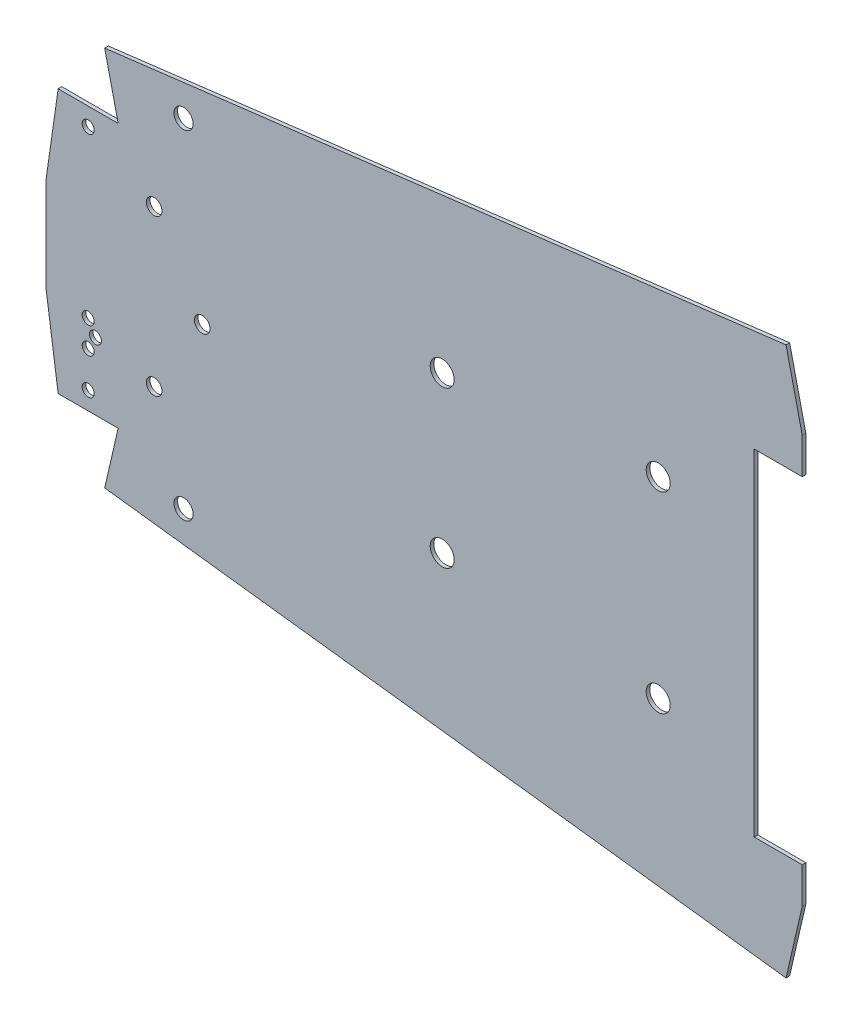
ISO-10303-21;
HEADER;
FILE_DESCRIPTION(('STEP AP214'),'2;1');
FILE_NAME('part.step','',(''),(''),'','','');
FILE_SCHEMA(('AUTOMOTIVE_DESIGN { 1 0 10303 214 1 1 1 1 }'));
ENDSEC;
DATA;
#1=APPLICATION_CONTEXT('core data for automotive mechanical design processes');
#2=APPLICATION_PROTOCOL_DEFINITION('international standard','automotive_design',2000,#1);
#3=PRODUCT_CONTEXT('',#1,'mechanical');
#4=PRODUCT('Part','Part','',(#3));
#5=PRODUCT_RELATED_PRODUCT_CATEGORY('part','',(#4));
#6=PRODUCT_DEFINITION_FORMATION('','',#4);
#7=PRODUCT_DEFINITION_CONTEXT('part definition',#1,'design');
#8=PRODUCT_DEFINITION('design','',#6,#7);
#9=PRODUCT_DEFINITION_SHAPE('','',#8);
#10=(LENGTH_UNIT() NAMED_UNIT(*) SI_UNIT(.MILLI.,.METRE.));
#11=(NAMED_UNIT(*) PLANE_ANGLE_UNIT() SI_UNIT($,.RADIAN.));
#12=(NAMED_UNIT(*) SI_UNIT($,.STERADIAN.) SOLID_ANGLE_UNIT());
#13=UNCERTAINTY_MEASURE_WITH_UNIT(LENGTH_MEASURE(1.E-05),#10,'distance_accuracy_value','');
#14=(GEOMETRIC_REPRESENTATION_CONTEXT(3) GLOBAL_UNCERTAINTY_ASSIGNED_CONTEXT((#13)) GLOBAL_UNIT_ASSIGNED_CONTEXT((#10,
#11,#12)) REPRESENTATION_CONTEXT('',''));
#15=CARTESIAN_POINT('',(0.,0.,0.));
#16=DIRECTION('',(0.,0.,1.));
#17=DIRECTION('',(1.,0.,0.));
#18=AXIS2_PLACEMENT_3D('',#15,#16,#17);
#19=CARTESIAN_POINT('',(-12.8984468051729,105.000156556674,-0.0001));
#20=DIRECTION('',(0.121925670687679,-0.992539233898267,0.));
#21=DIRECTION('',(0.992539233898268,0.121925670687679,0.));
#22=AXIS2_PLACEMENT_3D('',#19,#20,#21);
#23=PLANE('',#22);
#24=DIRECTION('',(0.,0.,1.));
#25=VECTOR('',#24,1.);
#26=CARTESIAN_POINT('',(-221.628929886641,79.3592516196309,-0.0001));
#27=LINE('',#26,#25);
#28=CARTESIAN_POINT('',(-221.628929886641,79.3592516196309,-0.0001));
#29=VERTEX_POINT('',#28);
#30=CARTESIAN_POINT('',(-221.628929886641,79.3592516196309,1.5));
#31=VERTEX_POINT('',#30);
#32=EDGE_CURVE('E43',#29,#31,#27,.T.);
#33=ORIENTED_EDGE('',*,*,#32,.T.);
#34=DIRECTION('',(0.992539233898268,0.121925670687679,0.));
#35=VECTOR('',#34,1.);
#36=CARTESIAN_POINT('',(-12.8984468051729,105.000156556674,1.5));
#37=LINE('',#36,#35);
#38=CARTESIAN_POINT('',(62.2463148416396,114.231101943557,1.5));
#39=VERTEX_POINT('',#38);
#40=EDGE_CURVE('E155',#31,#39,#37,.T.);
#41=ORIENTED_EDGE('',*,*,#40,.T.);
#42=DIRECTION('',(0.,0.,1.));
#43=VECTOR('',#42,1.);
#44=CARTESIAN_POINT('',(62.2463148416396,114.231101943557,-0.0001));
#45=LINE('',#44,#43);
#46=CARTESIAN_POINT('',(62.2463148416396,114.231101943557,-0.0001));
#47=VERTEX_POINT('',#46);
#48=EDGE_CURVE('E11',#47,#39,#45,.T.);
#49=ORIENTED_EDGE('',*,*,#48,.F.);
#50=DIRECTION('',(0.992539233898268,0.121925670687679,0.));
#51=VECTOR('',#50,1.);
#52=CARTESIAN_POINT('',(-12.8984468051729,105.000156556674,-0.0001));
#53=LINE('',#52,#51);
#54=EDGE_CURVE('E56',#29,#47,#53,.T.);
#55=ORIENTED_EDGE('',*,*,#54,.F.);
#56=EDGE_LOOP('',(#33,#41,#49,#55));
#57=FACE_BOUND('',#56,.T.);
#58=ADVANCED_FACE('F39',(#57),#23,.F.);
#59=CARTESIAN_POINT('',(84.1342755916733,19.4239280175096,-0.0001));
#60=DIRECTION('',(0.974370064785234,0.224951054343869,0.));
#61=DIRECTION('',(-0.224951054343869,0.974370064785234,0.));
#62=AXIS2_PLACEMENT_3D('',#59,#60,#61);
#63=PLANE('',#62);
#64=ORIENTED_EDGE('',*,*,#48,.T.);
#65=DIRECTION('',(-0.224951054343869,0.974370064785234,0.));
#66=VECTOR('',#65,1.);
#67=CARTESIAN_POINT('',(84.1342755916733,19.4239280175096,1.5));
#68=LINE('',#67,#66);
#69=CARTESIAN_POINT('',(68.9948464719557,85.,1.5));
#70=VERTEX_POINT('',#69);
#71=EDGE_CURVE('E169',#70,#39,#68,.T.);
#72=ORIENTED_EDGE('',*,*,#71,.F.);
#73=DIRECTION('',(0.,0.,1.));
#74=VECTOR('',#73,1.);
#75=CARTESIAN_POINT('',(68.9948464719557,85.,-0.0001));
#76=LINE('',#75,#74);
#77=CARTESIAN_POINT('',(68.9948464719557,85.,-0.0001));
#78=VERTEX_POINT('',#77);
#79=EDGE_CURVE('E48',#78,#70,#76,.T.);
#80=ORIENTED_EDGE('',*,*,#79,.F.);
#81=DIRECTION('',(-0.224951054343869,0.974370064785234,0.));
#82=VECTOR('',#81,1.);
#83=CARTESIAN_POINT('',(84.1342755916733,19.4239280175096,-0.0001));
#84=LINE('',#83,#82);
#85=EDGE_CURVE('E290',#78,#47,#84,.T.);
#86=ORIENTED_EDGE('',*,*,#85,.T.);
#87=EDGE_LOOP('',(#64,#72,#80,#86));
#88=FACE_BOUND('',#87,.T.);
#89=ADVANCED_FACE('F409',(#88),#63,.T.);
#90=CARTESIAN_POINT('',(68.9948464719557,0.,-0.0001));
#91=DIRECTION('',(1.,0.,0.));
#92=DIRECTION('',(0.,0.,-1.));
#93=AXIS2_PLACEMENT_3D('',#90,#91,#92);
#94=PLANE('',#93);
#95=ORIENTED_EDGE('',*,*,#79,.T.);
#96=DIRECTION('',(0.,1.,0.));
#97=VECTOR('',#96,1.);
#98=CARTESIAN_POINT('',(68.9948464719557,0.,1.5));
#99=LINE('',#98,#97);
#100=CARTESIAN_POINT('',(68.9948464719557,70.,1.5));
#101=VERTEX_POINT('',#100);
#102=EDGE_CURVE('E212',#101,#70,#99,.T.);
#103=ORIENTED_EDGE('',*,*,#102,.F.);
#104=DIRECTION('',(0.,0.,1.));
#105=VECTOR('',#104,1.);
#106=CARTESIAN_POINT('',(68.9948464719557,70.,-0.0001));
#107=LINE('',#106,#105);
#108=CARTESIAN_POINT('',(68.9948464719557,70.,-0.0001));
#109=VERTEX_POINT('',#108);
#110=EDGE_CURVE('E328',#109,#101,#107,.T.);
#111=ORIENTED_EDGE('',*,*,#110,.F.);
#112=DIRECTION('',(0.,1.,0.));
#113=VECTOR('',#112,1.);
#114=CARTESIAN_POINT('',(68.9948464719557,0.,-0.0001));
#115=LINE('',#114,#113);
#116=EDGE_CURVE('E288',#109,#78,#115,.T.);
#117=ORIENTED_EDGE('',*,*,#116,.T.);
#118=EDGE_LOOP('',(#95,#103,#111,#117));
#119=FACE_BOUND('',#118,.T.);
#120=ADVANCED_FACE('F407',(#119),#94,.T.);
#121=CARTESIAN_POINT('',(0.,70.,-0.0001));
#122=DIRECTION('',(0.,-1.,0.));
#123=DIRECTION('',(0.,0.,-1.));
#124=AXIS2_PLACEMENT_3D('',#121,#122,#123);
#125=PLANE('',#124);
#126=ORIENTED_EDGE('',*,*,#110,.T.);
#127=DIRECTION('',(1.,0.,0.));
#128=VECTOR('',#127,1.);
#129=CARTESIAN_POINT('',(0.,70.,1.5));
#130=LINE('',#129,#128);
#131=CARTESIAN_POINT('',(48.9948464719557,70.,1.5));
#132=VERTEX_POINT('',#131);
#133=EDGE_CURVE('E209',#132,#101,#130,.T.);
#134=ORIENTED_EDGE('',*,*,#133,.F.);
#135=DIRECTION('',(0.,0.,1.));
#136=VECTOR('',#135,1.);
#137=CARTESIAN_POINT('',(48.9948464719557,70.,-0.0001));
#138=LINE('',#137,#136);
#139=CARTESIAN_POINT('',(48.9948464719557,70.,-0.0001));
#140=VERTEX_POINT('',#139);
#141=EDGE_CURVE('E330',#140,#132,#138,.T.);
#142=ORIENTED_EDGE('',*,*,#141,.F.);
#143=DIRECTION('',(1.,0.,0.));
#144=VECTOR('',#143,1.);
#145=CARTESIAN_POINT('',(0.,70.,-0.0001));
#146=LINE('',#145,#144);
#147=EDGE_CURVE('E285',#140,#109,#146,.T.);
#148=ORIENTED_EDGE('',*,*,#147,.T.);
#149=EDGE_LOOP('',(#126,#134,#142,#148));
#150=FACE_BOUND('',#149,.T.);
#151=ADVANCED_FACE('F404',(#150),#125,.T.);
#152=CARTESIAN_POINT('',(48.9948464719557,0.,-0.0001));
#153=DIRECTION('',(-1.,0.,0.));
#154=DIRECTION('',(0.,0.,1.));
#155=AXIS2_PLACEMENT_3D('',#152,#153,#154);
#156=PLANE('',#155);
#157=ORIENTED_EDGE('',*,*,#141,.T.);
#158=DIRECTION('',(0.,-1.,0.));
#159=VECTOR('',#158,1.);
#160=CARTESIAN_POINT('',(48.9948464719557,0.,1.5));
#161=LINE('',#160,#159);
#162=CARTESIAN_POINT('',(48.9948464719557,-70.,1.5));
#163=VERTEX_POINT('',#162);
#164=EDGE_CURVE('E206',#132,#163,#161,.T.);
#165=ORIENTED_EDGE('',*,*,#164,.T.);
#166=DIRECTION('',(0.,0.,1.));
#167=VECTOR('',#166,1.);
#168=CARTESIAN_POINT('',(48.9948464719557,-70.,-0.0001));
#169=LINE('',#168,#167);
#170=CARTESIAN_POINT('',(48.9948464719557,-70.,-0.0001));
#171=VERTEX_POINT('',#170);
#172=EDGE_CURVE('E332',#171,#163,#169,.T.);
#173=ORIENTED_EDGE('',*,*,#172,.F.);
#174=DIRECTION('',(0.,-1.,0.));
#175=VECTOR('',#174,1.);
#176=CARTESIAN_POINT('',(48.9948464719557,0.,-0.0001));
#177=LINE('',#176,#175);
#178=EDGE_CURVE('E283',#140,#171,#177,.T.);
#179=ORIENTED_EDGE('',*,*,#178,.F.);
#180=EDGE_LOOP('',(#157,#165,#173,#179));
#181=FACE_BOUND('',#180,.T.);
#182=ADVANCED_FACE('F399',(#181),#156,.F.);
#183=CARTESIAN_POINT('',(0.,-70.,-0.0001));
#184=DIRECTION('',(0.,-1.,0.));
#185=DIRECTION('',(0.,0.,-1.));
#186=AXIS2_PLACEMENT_3D('',#183,#184,#185);
#187=PLANE('',#186);
#188=ORIENTED_EDGE('',*,*,#172,.T.);
#189=DIRECTION('',(1.,0.,0.));
#190=VECTOR('',#189,1.);
#191=CARTESIAN_POINT('',(0.,-70.,1.5));
#192=LINE('',#191,#190);
#193=CARTESIAN_POINT('',(68.9948464719557,-70.,1.5));
#194=VERTEX_POINT('',#193);
#195=EDGE_CURVE('E203',#163,#194,#192,.T.);
#196=ORIENTED_EDGE('',*,*,#195,.T.);
#197=DIRECTION('',(0.,0.,1.));
#198=VECTOR('',#197,1.);
#199=CARTESIAN_POINT('',(68.9948464719557,-70.,-0.0001));
#200=LINE('',#199,#198);
#201=CARTESIAN_POINT('',(68.9948464719557,-70.,-0.0001));
#202=VERTEX_POINT('',#201);
#203=EDGE_CURVE('E334',#202,#194,#200,.T.);
#204=ORIENTED_EDGE('',*,*,#203,.F.);
#205=DIRECTION('',(1.,0.,0.));
#206=VECTOR('',#205,1.);
#207=CARTESIAN_POINT('',(0.,-70.,-0.0001));
#208=LINE('',#207,#206);
#209=EDGE_CURVE('E281',#171,#202,#208,.T.);
#210=ORIENTED_EDGE('',*,*,#209,.F.);
#211=EDGE_LOOP('',(#188,#196,#204,#210));
#212=FACE_BOUND('',#211,.T.);
#213=ADVANCED_FACE('F395',(#212),#187,.F.);
#214=CARTESIAN_POINT('',(68.9948464719557,0.,-0.0001));
#215=DIRECTION('',(-1.,0.,0.));
#216=DIRECTION('',(0.,0.,1.));
#217=AXIS2_PLACEMENT_3D('',#214,#215,#216);
#218=PLANE('',#217);
#219=ORIENTED_EDGE('',*,*,#203,.T.);
#220=DIRECTION('',(0.,-1.,0.));
#221=VECTOR('',#220,1.);
#222=CARTESIAN_POINT('',(68.9948464719557,0.,1.5));
#223=LINE('',#222,#221);
#224=CARTESIAN_POINT('',(68.9948464719557,-85.,1.5));
#225=VERTEX_POINT('',#224);
#226=EDGE_CURVE('E200',#194,#225,#223,.T.);
#227=ORIENTED_EDGE('',*,*,#226,.T.);
#228=DIRECTION('',(0.,0.,1.));
#229=VECTOR('',#228,1.);
#230=CARTESIAN_POINT('',(68.9948464719557,-85.,-0.0001));
#231=LINE('',#230,#229);
#232=CARTESIAN_POINT('',(68.9948464719557,-85.,-0.0001));
#233=VERTEX_POINT('',#232);
#234=EDGE_CURVE('E336',#233,#225,#231,.T.);
#235=ORIENTED_EDGE('',*,*,#234,.F.);
#236=DIRECTION('',(0.,-1.,0.));
#237=VECTOR('',#236,1.);
#238=CARTESIAN_POINT('',(68.9948464719557,0.,-0.0001));
#239=LINE('',#238,#237);
#240=EDGE_CURVE('E279',#202,#233,#239,.T.);
#241=ORIENTED_EDGE('',*,*,#240,.F.);
#242=EDGE_LOOP('',(#219,#227,#235,#241));
#243=FACE_BOUND('',#242,.T.);
#244=ADVANCED_FACE('F390',(#243),#218,.F.);
#245=CARTESIAN_POINT('',(84.1342755916733,-19.4239280175096,-0.0001));
#246=DIRECTION('',(-0.974370064785234,0.224951054343869,0.));
#247=DIRECTION('',(-0.224951054343869,-0.974370064785234,0.));
#248=AXIS2_PLACEMENT_3D('',#245,#246,#247);
#249=PLANE('',#248);
#250=ORIENTED_EDGE('',*,*,#234,.T.);
#251=DIRECTION('',(-0.224951054343869,-0.974370064785234,0.));
#252=VECTOR('',#251,1.);
#253=CARTESIAN_POINT('',(84.1342755916733,-19.4239280175096,1.5));
#254=LINE('',#253,#252);
#255=CARTESIAN_POINT('',(62.2463148416396,-114.231101943557,1.5));
#256=VERTEX_POINT('',#255);
#257=EDGE_CURVE('E197',#225,#256,#254,.T.);
#258=ORIENTED_EDGE('',*,*,#257,.T.);
#259=DIRECTION('',(0.,0.,1.));
#260=VECTOR('',#259,1.);
#261=CARTESIAN_POINT('',(62.2463148416396,-114.231101943557,-0.0001));
#262=LINE('',#261,#260);
#263=CARTESIAN_POINT('',(62.2463148416396,-114.231101943557,-0.0001));
#264=VERTEX_POINT('',#263);
#265=EDGE_CURVE('E338',#264,#256,#262,.T.);
#266=ORIENTED_EDGE('',*,*,#265,.F.);
#267=DIRECTION('',(-0.224951054343869,-0.974370064785234,0.));
#268=VECTOR('',#267,1.);
#269=CARTESIAN_POINT('',(84.1342755916733,-19.4239280175096,-0.0001));
#270=LINE('',#269,#268);
#271=EDGE_CURVE('E277',#233,#264,#270,.T.);
#272=ORIENTED_EDGE('',*,*,#271,.F.);
#273=EDGE_LOOP('',(#250,#258,#266,#272));
#274=FACE_BOUND('',#273,.T.);
#275=ADVANCED_FACE('F385',(#274),#249,.F.);
#276=CARTESIAN_POINT('',(-12.8984468051729,-105.000156556674,-0.0001));
#277=DIRECTION('',(0.121925670687679,0.992539233898267,0.));
#278=DIRECTION('',(-0.992539233898268,0.121925670687679,0.));
#279=AXIS2_PLACEMENT_3D('',#276,#277,#278);
#280=PLANE('',#279);
#281=ORIENTED_EDGE('',*,*,#265,.T.);
#282=DIRECTION('',(-0.992539233898268,0.121925670687679,0.));
#283=VECTOR('',#282,1.);
#284=CARTESIAN_POINT('',(-12.8984468051729,-105.000156556674,1.5));
#285=LINE('',#284,#283);
#286=CARTESIAN_POINT('',(-221.628929886641,-79.3592516196309,1.5));
#287=VERTEX_POINT('',#286);
#288=EDGE_CURVE('E194',#256,#287,#285,.T.);
#289=ORIENTED_EDGE('',*,*,#288,.T.);
#290=DIRECTION('',(0.,0.,1.));
#291=VECTOR('',#290,1.);
#292=CARTESIAN_POINT('',(-221.628929886641,-79.3592516196309,-0.0001));
#293=LINE('',#292,#291);
#294=CARTESIAN_POINT('',(-221.628929886641,-79.3592516196309,-0.0001));
#295=VERTEX_POINT('',#294);
#296=EDGE_CURVE('E340',#295,#287,#293,.T.);
#297=ORIENTED_EDGE('',*,*,#296,.F.);
#298=DIRECTION('',(-0.992539233898268,0.121925670687679,0.));
#299=VECTOR('',#298,1.);
#300=CARTESIAN_POINT('',(-12.8984468051729,-105.000156556674,-0.0001));
#301=LINE('',#300,#299);
#302=EDGE_CURVE('E275',#264,#295,#301,.T.);
#303=ORIENTED_EDGE('',*,*,#302,.F.);
#304=EDGE_LOOP('',(#281,#289,#297,#303));
#305=FACE_BOUND('',#304,.T.);
#306=ADVANCED_FACE('F380',(#305),#280,.F.);
#307=CARTESIAN_POINT('',(-193.019443207794,44.5620497054474,-0.0001));
#308=DIRECTION('',(-0.974370064785234,0.224951054343868,0.));
#309=DIRECTION('',(-0.224951054343868,-0.974370064785234,0.));
#310=AXIS2_PLACEMENT_3D('',#307,#308,#309);
#311=PLANE('',#310);
#312=ORIENTED_EDGE('',*,*,#296,.T.);
#313=DIRECTION('',(-0.224951054343868,-0.974370064785235,0.));
#314=VECTOR('',#313,1.);
#315=CARTESIAN_POINT('',(-193.019443207794,44.5620497054474,1.5));
#316=LINE('',#315,#314);
#317=CARTESIAN_POINT('',(-216.005153528044,-55.,1.5));
#318=VERTEX_POINT('',#317);
#319=EDGE_CURVE('E191',#318,#287,#316,.T.);
#320=ORIENTED_EDGE('',*,*,#319,.F.);
#321=DIRECTION('',(0.,0.,1.));
#322=VECTOR('',#321,1.);
#323=CARTESIAN_POINT('',(-216.005153528044,-55.,-0.0001));
#324=LINE('',#323,#322);
#325=CARTESIAN_POINT('',(-216.005153528044,-55.,-0.0001));
#326=VERTEX_POINT('',#325);
#327=EDGE_CURVE('E342',#326,#318,#324,.T.);
#328=ORIENTED_EDGE('',*,*,#327,.F.);
#329=DIRECTION('',(-0.224951054343868,-0.974370064785235,0.));
#330=VECTOR('',#329,1.);
#331=CARTESIAN_POINT('',(-193.019443207794,44.5620497054474,-0.0001));
#332=LINE('',#331,#330);
#333=EDGE_CURVE('E272',#326,#295,#332,.T.);
#334=ORIENTED_EDGE('',*,*,#333,.T.);
#335=EDGE_LOOP('',(#312,#320,#328,#334));
#336=FACE_BOUND('',#335,.T.);
#337=ADVANCED_FACE('F375',(#336),#311,.T.);
#338=CARTESIAN_POINT('',(0.,-55.,-0.0001));
#339=DIRECTION('',(0.,1.,0.));
#340=DIRECTION('',(0.,0.,1.));
#341=AXIS2_PLACEMENT_3D('',#338,#339,#340);
#342=PLANE('',#341);
#343=ORIENTED_EDGE('',*,*,#327,.T.);
#344=DIRECTION('',(-1.,0.,0.));
#345=VECTOR('',#344,1.);
#346=CARTESIAN_POINT('',(0.,-55.,1.5));
#347=LINE('',#346,#345);
#348=CARTESIAN_POINT('',(-241.005153528044,-55.,1.5));
#349=VERTEX_POINT('',#348);
#350=EDGE_CURVE('E188',#318,#349,#347,.T.);
#351=ORIENTED_EDGE('',*,*,#350,.T.);
#352=DIRECTION('',(0.,0.,1.));
#353=VECTOR('',#352,1.);
#354=CARTESIAN_POINT('',(-241.005153528044,-55.,-0.0001));
#355=LINE('',#354,#353);
#356=CARTESIAN_POINT('',(-241.005153528044,-55.,-0.0001));
#357=VERTEX_POINT('',#356);
#358=EDGE_CURVE('E344',#357,#349,#355,.T.);
#359=ORIENTED_EDGE('',*,*,#358,.F.);
#360=DIRECTION('',(-1.,0.,0.));
#361=VECTOR('',#360,1.);
#362=CARTESIAN_POINT('',(0.,-55.,-0.0001));
#363=LINE('',#362,#361);
#364=EDGE_CURVE('E270',#326,#357,#363,.T.);
#365=ORIENTED_EDGE('',*,*,#364,.F.);
#366=EDGE_LOOP('',(#343,#351,#359,#365));
#367=FACE_BOUND('',#366,.T.);
#368=ADVANCED_FACE('F370',(#367),#342,.F.);
#369=CARTESIAN_POINT('',(-243.885050457483,-34.8407214939262,-0.0001));
#370=DIRECTION('',(-0.989949493661166,-0.14142135623731,0.));
#371=DIRECTION('',(0.14142135623731,-0.989949493661167,0.));
#372=AXIS2_PLACEMENT_3D('',#369,#370,#371);
#373=PLANE('',#372);
#374=ORIENTED_EDGE('',*,*,#358,.T.);
#375=DIRECTION('',(0.14142135623731,-0.989949493661167,0.));
#376=VECTOR('',#375,1.);
#377=CARTESIAN_POINT('',(-243.885050457483,-34.8407214939262,1.5));
#378=LINE('',#377,#376);
#379=CARTESIAN_POINT('',(-246.005153528044,-20.,1.5));
#380=VERTEX_POINT('',#379);
#381=EDGE_CURVE('E185',#380,#349,#378,.T.);
#382=ORIENTED_EDGE('',*,*,#381,.F.);
#383=DIRECTION('',(0.,0.,1.));
#384=VECTOR('',#383,1.);
#385=CARTESIAN_POINT('',(-246.005153528044,-20.,-0.0001));
#386=LINE('',#385,#384);
#387=CARTESIAN_POINT('',(-246.005153528044,-20.,-0.0001));
#388=VERTEX_POINT('',#387);
#389=EDGE_CURVE('E346',#388,#380,#386,.T.);
#390=ORIENTED_EDGE('',*,*,#389,.F.);
#391=DIRECTION('',(0.14142135623731,-0.989949493661167,0.));
#392=VECTOR('',#391,1.);
#393=CARTESIAN_POINT('',(-243.885050457483,-34.8407214939262,-0.0001));
#394=LINE('',#393,#392);
#395=EDGE_CURVE('E267',#388,#357,#394,.T.);
#396=ORIENTED_EDGE('',*,*,#395,.T.);
#397=EDGE_LOOP('',(#374,#382,#390,#396));
#398=FACE_BOUND('',#397,.T.);
#399=ADVANCED_FACE('F412',(#398),#373,.T.);
#400=CARTESIAN_POINT('',(-246.005153528044,0.,-0.0001));
#401=DIRECTION('',(1.,0.,0.));
#402=DIRECTION('',(0.,0.,-1.));
#403=AXIS2_PLACEMENT_3D('',#400,#401,#402);
#404=PLANE('',#403);
#405=ORIENTED_EDGE('',*,*,#389,.T.);
#406=DIRECTION('',(0.,1.,0.));
#407=VECTOR('',#406,1.);
#408=CARTESIAN_POINT('',(-246.005153528044,0.,1.5));
#409=LINE('',#408,#407);
#410=CARTESIAN_POINT('',(-246.005153528044,20.,1.5));
#411=VERTEX_POINT('',#410);
#412=EDGE_CURVE('E182',#380,#411,#409,.T.);
#413=ORIENTED_EDGE('',*,*,#412,.T.);
#414=DIRECTION('',(0.,0.,1.));
#415=VECTOR('',#414,1.);
#416=CARTESIAN_POINT('',(-246.005153528044,20.,-0.0001));
#417=LINE('',#416,#415);
#418=CARTESIAN_POINT('',(-246.005153528044,20.,-0.0001));
#419=VERTEX_POINT('',#418);
#420=EDGE_CURVE('E348',#419,#411,#417,.T.);
#421=ORIENTED_EDGE('',*,*,#420,.F.);
#422=DIRECTION('',(0.,1.,0.));
#423=VECTOR('',#422,1.);
#424=CARTESIAN_POINT('',(-246.005153528044,0.,-0.0001));
#425=LINE('',#424,#423);
#426=EDGE_CURVE('E265',#388,#419,#425,.T.);
#427=ORIENTED_EDGE('',*,*,#426,.F.);
#428=EDGE_LOOP('',(#405,#413,#421,#427));
#429=FACE_BOUND('',#428,.T.);
#430=ADVANCED_FACE('F363',(#429),#404,.F.);
#431=CARTESIAN_POINT('',(-243.885050457483,34.8407214939262,-0.0001));
#432=DIRECTION('',(0.989949493661166,-0.14142135623731,0.));
#433=DIRECTION('',(0.14142135623731,0.989949493661167,0.));
#434=AXIS2_PLACEMENT_3D('',#431,#432,#433);
#435=PLANE('',#434);
#436=ORIENTED_EDGE('',*,*,#420,.T.);
#437=DIRECTION('',(0.14142135623731,0.989949493661167,0.));
#438=VECTOR('',#437,1.);
#439=CARTESIAN_POINT('',(-243.885050457483,34.8407214939262,1.5));
#440=LINE('',#439,#438);
#441=CARTESIAN_POINT('',(-241.005153528044,55.,1.5));
#442=VERTEX_POINT('',#441);
#443=EDGE_CURVE('E176',#411,#442,#440,.T.);
#444=ORIENTED_EDGE('',*,*,#443,.T.);
#445=DIRECTION('',(0.,0.,1.));
#446=VECTOR('',#445,1.);
#447=CARTESIAN_POINT('',(-241.005153528044,55.,-0.0001));
#448=LINE('',#447,#446);
#449=CARTESIAN_POINT('',(-241.005153528044,55.,-0.0001));
#450=VERTEX_POINT('',#449);
#451=EDGE_CURVE('E350',#450,#442,#448,.T.);
#452=ORIENTED_EDGE('',*,*,#451,.F.);
#453=DIRECTION('',(0.14142135623731,0.989949493661167,0.));
#454=VECTOR('',#453,1.);
#455=CARTESIAN_POINT('',(-243.885050457483,34.8407214939262,-0.0001));
#456=LINE('',#455,#454);
#457=EDGE_CURVE('E263',#419,#450,#456,.T.);
#458=ORIENTED_EDGE('',*,*,#457,.F.);
#459=EDGE_LOOP('',(#436,#444,#452,#458));
#460=FACE_BOUND('',#459,.T.);
#461=ADVANCED_FACE('F359',(#460),#435,.F.);
#462=CARTESIAN_POINT('',(0.,55.,-0.0001));
#463=DIRECTION('',(0.,1.,0.));
#464=DIRECTION('',(0.,0.,1.));
#465=AXIS2_PLACEMENT_3D('',#462,#463,#464);
#466=PLANE('',#465);
#467=ORIENTED_EDGE('',*,*,#451,.T.);
#468=DIRECTION('',(-1.,0.,0.));
#469=VECTOR('',#468,1.);
#470=CARTESIAN_POINT('',(0.,55.,1.5));
#471=LINE('',#470,#469);
#472=CARTESIAN_POINT('',(-216.005153528044,55.,1.5));
#473=VERTEX_POINT('',#472);
#474=EDGE_CURVE('E174',#473,#442,#471,.T.);
#475=ORIENTED_EDGE('',*,*,#474,.F.);
#476=DIRECTION('',(0.,0.,1.));
#477=VECTOR('',#476,1.);
#478=CARTESIAN_POINT('',(-216.005153528044,55.,-0.0001));
#479=LINE('',#478,#477);
#480=CARTESIAN_POINT('',(-216.005153528044,55.,-0.0001));
#481=VERTEX_POINT('',#480);
#482=EDGE_CURVE('E159',#481,#473,#479,.T.);
#483=ORIENTED_EDGE('',*,*,#482,.F.);
#484=DIRECTION('',(-1.,0.,0.));
#485=VECTOR('',#484,1.);
#486=CARTESIAN_POINT('',(0.,55.,-0.0001));
#487=LINE('',#486,#485);
#488=EDGE_CURVE('E260',#481,#450,#487,.T.);
#489=ORIENTED_EDGE('',*,*,#488,.T.);
#490=EDGE_LOOP('',(#467,#475,#483,#489));
#491=FACE_BOUND('',#490,.T.);
#492=ADVANCED_FACE('F353',(#491),#466,.T.);
#493=CARTESIAN_POINT('',(-228.505153528044,-32.5,-0.0001));
#494=DIRECTION('',(0.,0.,1.));
#495=DIRECTION('',(1.,0.,0.));
#496=AXIS2_PLACEMENT_3D('',#493,#494,#495);
#497=CYLINDRICAL_SURFACE('',#496,2.5);
#498=CARTESIAN_POINT('',(-228.505153528044,-32.5,-0.0001));
#499=DIRECTION('',(0.,0.,1.));
#500=DIRECTION('',(1.,0.,0.));
#501=AXIS2_PLACEMENT_3D('',#498,#499,#500);
#502=CIRCLE('',#501,2.5);
#503=CARTESIAN_POINT('',(-226.005153528044,-32.5,-0.0001));
#504=VERTEX_POINT('',#503);
#505=EDGE_CURVE('E322',#504,#504,#502,.T.);
#506=ORIENTED_EDGE('',*,*,#505,.F.);
#507=EDGE_LOOP('',(#506));
#508=FACE_BOUND('',#507,.T.);
#509=CARTESIAN_POINT('',(-228.505153528044,-32.5,1.5));
#510=DIRECTION('',(0.,0.,1.));
#511=DIRECTION('',(1.,0.,0.));
#512=AXIS2_PLACEMENT_3D('',#509,#510,#511);
#513=CIRCLE('',#512,2.5);
#514=CARTESIAN_POINT('',(-226.005153528044,-32.5,1.5));
#515=VERTEX_POINT('',#514);
#516=EDGE_CURVE('E245',#515,#515,#513,.T.);
#517=ORIENTED_EDGE('',*,*,#516,.T.);
#518=EDGE_LOOP('',(#517));
#519=FACE_BOUND('',#518,.T.);
#520=ADVANCED_FACE('F461',(#508,#519),#497,.F.);
#521=CARTESIAN_POINT('',(-228.505153528044,-21.5,-0.0001));
#522=DIRECTION('',(0.,0.,1.));
#523=DIRECTION('',(1.,0.,0.));
#524=AXIS2_PLACEMENT_3D('',#521,#522,#523);
#525=CYLINDRICAL_SURFACE('',#524,2.5);
#526=CARTESIAN_POINT('',(-228.505153528044,-21.5,-0.0001));
#527=DIRECTION('',(0.,0.,1.));
#528=DIRECTION('',(1.,0.,0.));
#529=AXIS2_PLACEMENT_3D('',#526,#527,#528);
#530=CIRCLE('',#529,2.5);
#531=CARTESIAN_POINT('',(-226.005153528044,-21.5,-0.0001));
#532=VERTEX_POINT('',#531);
#533=EDGE_CURVE('E319',#532,#532,#530,.T.);
#534=ORIENTED_EDGE('',*,*,#533,.F.);
#535=EDGE_LOOP('',(#534));
#536=FACE_BOUND('',#535,.T.);
#537=CARTESIAN_POINT('',(-228.505153528044,-21.5,1.5));
#538=DIRECTION('',(0.,0.,1.));
#539=DIRECTION('',(1.,0.,0.));
#540=AXIS2_PLACEMENT_3D('',#537,#538,#539);
#541=CIRCLE('',#540,2.5);
#542=CARTESIAN_POINT('',(-226.005153528044,-21.5,1.5));
#543=VERTEX_POINT('',#542);
#544=EDGE_CURVE('E242',#543,#543,#541,.T.);
#545=ORIENTED_EDGE('',*,*,#544,.T.);
#546=EDGE_LOOP('',(#545));
#547=FACE_BOUND('',#546,.T.);
#548=ADVANCED_FACE('F464',(#536,#547),#525,.F.);
#549=CARTESIAN_POINT('',(-225.505153528044,-27.,-0.0001));
#550=DIRECTION('',(0.,0.,1.));
#551=DIRECTION('',(1.,0.,0.));
#552=AXIS2_PLACEMENT_3D('',#549,#550,#551);
#553=CYLINDRICAL_SURFACE('',#552,2.5);
#554=CARTESIAN_POINT('',(-225.505153528044,-27.,-0.0001));
#555=DIRECTION('',(0.,0.,1.));
#556=DIRECTION('',(1.,0.,0.));
#557=AXIS2_PLACEMENT_3D('',#554,#555,#556);
#558=CIRCLE('',#557,2.5);
#559=CARTESIAN_POINT('',(-223.005153528044,-27.,-0.0001));
#560=VERTEX_POINT('',#559);
#561=EDGE_CURVE('E316',#560,#560,#558,.T.);
#562=ORIENTED_EDGE('',*,*,#561,.F.);
#563=EDGE_LOOP('',(#562));
#564=FACE_BOUND('',#563,.T.);
#565=CARTESIAN_POINT('',(-225.505153528044,-27.,1.5));
#566=DIRECTION('',(0.,0.,1.));
#567=DIRECTION('',(1.,0.,0.));
#568=AXIS2_PLACEMENT_3D('',#565,#566,#567);
#569=CIRCLE('',#568,2.5);
#570=CARTESIAN_POINT('',(-223.005153528044,-27.,1.5));
#571=VERTEX_POINT('',#570);
#572=EDGE_CURVE('E239',#571,#571,#569,.T.);
#573=ORIENTED_EDGE('',*,*,#572,.T.);
#574=EDGE_LOOP('',(#573));
#575=FACE_BOUND('',#574,.T.);
#576=ADVANCED_FACE('F468',(#564,#575),#553,.F.);
#577=CARTESIAN_POINT('',(-188.779463149944,-70.4349234441045,-0.0001));
#578=DIRECTION('',(0.,0.,1.));
#579=DIRECTION('',(1.,0.,0.));
#580=AXIS2_PLACEMENT_3D('',#577,#578,#579);
#581=CYLINDRICAL_SURFACE('',#580,3.99999999999999);
#582=CARTESIAN_POINT('',(-188.779463149944,-70.4349234441045,-0.0001));
#583=DIRECTION('',(0.,0.,1.));
#584=DIRECTION('',(1.,0.,0.));
#585=AXIS2_PLACEMENT_3D('',#582,#583,#584);
#586=CIRCLE('',#585,3.99999999999999);
#587=CARTESIAN_POINT('',(-184.779463149944,-70.4349234441045,-0.0001));
#588=VERTEX_POINT('',#587);
#589=EDGE_CURVE('E313',#588,#588,#586,.F.);
#590=ORIENTED_EDGE('',*,*,#589,.T.);
#591=EDGE_LOOP('',(#590));
#592=FACE_BOUND('',#591,.T.);
#593=CARTESIAN_POINT('',(-188.779463149944,-70.4349234441045,1.5));
#594=DIRECTION('',(0.,0.,1.));
#595=DIRECTION('',(1.,0.,0.));
#596=AXIS2_PLACEMENT_3D('',#593,#594,#595);
#597=CIRCLE('',#596,3.99999999999999);
#598=CARTESIAN_POINT('',(-184.779463149944,-70.4349234441045,1.5));
#599=VERTEX_POINT('',#598);
#600=EDGE_CURVE('E236',#599,#599,#597,.F.);
#601=ORIENTED_EDGE('',*,*,#600,.F.);
#602=EDGE_LOOP('',(#601));
#603=FACE_BOUND('',#602,.T.);
#604=ADVANCED_FACE('F472',(#592,#603),#581,.F.);
#605=CARTESIAN_POINT('',(-228.505153528044,47.5,-0.0001));
#606=DIRECTION('',(0.,0.,1.));
#607=DIRECTION('',(1.,0.,0.));
#608=AXIS2_PLACEMENT_3D('',#605,#606,#607);
#609=CYLINDRICAL_SURFACE('',#608,2.5);
#610=CARTESIAN_POINT('',(-228.505153528044,47.5,-0.0001));
#611=DIRECTION('',(0.,0.,1.));
#612=DIRECTION('',(1.,0.,0.));
#613=AXIS2_PLACEMENT_3D('',#610,#611,#612);
#614=CIRCLE('',#613,2.5);
#615=CARTESIAN_POINT('',(-226.005153528044,47.5,-0.0001));
#616=VERTEX_POINT('',#615);
#617=EDGE_CURVE('E310',#616,#616,#614,.T.);
#618=ORIENTED_EDGE('',*,*,#617,.F.);
#619=EDGE_LOOP('',(#618));
#620=FACE_BOUND('',#619,.T.);
#621=CARTESIAN_POINT('',(-228.505153528044,47.5,1.5));
#622=DIRECTION('',(0.,0.,1.));
#623=DIRECTION('',(1.,0.,0.));
#624=AXIS2_PLACEMENT_3D('',#621,#622,#623);
#625=CIRCLE('',#624,2.5);
#626=CARTESIAN_POINT('',(-226.005153528044,47.5,1.5));
#627=VERTEX_POINT('',#626);
#628=EDGE_CURVE('E233',#627,#627,#625,.T.);
#629=ORIENTED_EDGE('',*,*,#628,.T.);
#630=EDGE_LOOP('',(#629));
#631=FACE_BOUND('',#630,.T.);
#632=ADVANCED_FACE('F476',(#620,#631),#609,.F.);
#633=CARTESIAN_POINT('',(-201.005153528044,-32.5,-0.0001));
#634=DIRECTION('',(0.,0.,1.));
#635=DIRECTION('',(1.,0.,0.));
#636=AXIS2_PLACEMENT_3D('',#633,#634,#635);
#637=CYLINDRICAL_SURFACE('',#636,3.25000000000001);
#638=CARTESIAN_POINT('',(-201.005153528044,-32.5,-0.0001));
#639=DIRECTION('',(0.,0.,1.));
#640=DIRECTION('',(1.,0.,0.));
#641=AXIS2_PLACEMENT_3D('',#638,#639,#640);
#642=CIRCLE('',#641,3.25000000000001);
#643=CARTESIAN_POINT('',(-197.755153528044,-32.5,-0.0001));
#644=VERTEX_POINT('',#643);
#645=EDGE_CURVE('E307',#644,#644,#642,.F.);
#646=ORIENTED_EDGE('',*,*,#645,.T.);
#647=EDGE_LOOP('',(#646));
#648=FACE_BOUND('',#647,.T.);
#649=CARTESIAN_POINT('',(-201.005153528044,-32.5,1.5));
#650=DIRECTION('',(0.,0.,1.));
#651=DIRECTION('',(1.,0.,0.));
#652=AXIS2_PLACEMENT_3D('',#649,#650,#651);
#653=CIRCLE('',#652,3.25000000000001);
#654=CARTESIAN_POINT('',(-197.755153528044,-32.5,1.5));
#655=VERTEX_POINT('',#654);
#656=EDGE_CURVE('E230',#655,#655,#653,.F.);
#657=ORIENTED_EDGE('',*,*,#656,.F.);
#658=EDGE_LOOP('',(#657));
#659=FACE_BOUND('',#658,.T.);
#660=ADVANCED_FACE('F480',(#648,#659),#637,.F.);
#661=CARTESIAN_POINT('',(8.99484647195572,-40.,-0.0001));
#662=DIRECTION('',(0.,0.,1.));
#663=DIRECTION('',(1.,0.,0.));
#664=AXIS2_PLACEMENT_3D('',#661,#662,#663);
#665=CYLINDRICAL_SURFACE('',#664,5.);
#666=CARTESIAN_POINT('',(8.99484647195572,-40.,-0.0001));
#667=DIRECTION('',(0.,0.,1.));
#668=DIRECTION('',(1.,0.,0.));
#669=AXIS2_PLACEMENT_3D('',#666,#667,#668);
#670=CIRCLE('',#669,5.);
#671=CARTESIAN_POINT('',(13.9948464719557,-40.,-0.0001));
#672=VERTEX_POINT('',#671);
#673=EDGE_CURVE('E304',#672,#672,#670,.F.);
#674=ORIENTED_EDGE('',*,*,#673,.T.);
#675=EDGE_LOOP('',(#674));
#676=FACE_BOUND('',#675,.T.);
#677=CARTESIAN_POINT('',(8.99484647195572,-40.,1.5));
#678=DIRECTION('',(0.,0.,1.));
#679=DIRECTION('',(1.,0.,0.));
#680=AXIS2_PLACEMENT_3D('',#677,#678,#679);
#681=CIRCLE('',#680,5.);
#682=CARTESIAN_POINT('',(13.9948464719557,-40.,1.5));
#683=VERTEX_POINT('',#682);
#684=EDGE_CURVE('E227',#683,#683,#681,.F.);
#685=ORIENTED_EDGE('',*,*,#684,.F.);
#686=EDGE_LOOP('',(#685));
#687=FACE_BOUND('',#686,.T.);
#688=ADVANCED_FACE('F484',(#676,#687),#665,.F.);
#689=CARTESIAN_POINT('',(-81.0051535280443,-32.5,-0.0001));
#690=DIRECTION('',(0.,0.,1.));
#691=DIRECTION('',(1.,0.,0.));
#692=AXIS2_PLACEMENT_3D('',#689,#690,#691);
#693=CYLINDRICAL_SURFACE('',#692,5.);
#694=CARTESIAN_POINT('',(-81.0051535280443,-32.5,-0.0001));
#695=DIRECTION('',(0.,0.,1.));
#696=DIRECTION('',(1.,0.,0.));
#697=AXIS2_PLACEMENT_3D('',#694,#695,#696);
#698=CIRCLE('',#697,5.);
#699=CARTESIAN_POINT('',(-76.0051535280443,-32.5,-0.0001));
#700=VERTEX_POINT('',#699);
#701=EDGE_CURVE('E301',#700,#700,#698,.F.);
#702=ORIENTED_EDGE('',*,*,#701,.T.);
#703=EDGE_LOOP('',(#702));
#704=FACE_BOUND('',#703,.T.);
#705=CARTESIAN_POINT('',(-81.0051535280443,-32.5,1.5));
#706=DIRECTION('',(0.,0.,1.));
#707=DIRECTION('',(1.,0.,0.));
#708=AXIS2_PLACEMENT_3D('',#705,#706,#707);
#709=CIRCLE('',#708,5.);
#710=CARTESIAN_POINT('',(-76.0051535280443,-32.5,1.5));
#711=VERTEX_POINT('',#710);
#712=EDGE_CURVE('E224',#711,#711,#709,.F.);
#713=ORIENTED_EDGE('',*,*,#712,.F.);
#714=EDGE_LOOP('',(#713));
#715=FACE_BOUND('',#714,.T.);
#716=ADVANCED_FACE('F488',(#704,#715),#693,.F.);
#717=CARTESIAN_POINT('',(-81.0051535280443,32.5,-0.0001));
#718=DIRECTION('',(0.,0.,1.));
#719=DIRECTION('',(1.,0.,0.));
#720=AXIS2_PLACEMENT_3D('',#717,#718,#719);
#721=CYLINDRICAL_SURFACE('',#720,5.00000000000001);
#722=CARTESIAN_POINT('',(-81.0051535280443,32.5,-0.0001));
#723=DIRECTION('',(0.,0.,1.));
#724=DIRECTION('',(1.,0.,0.));
#725=AXIS2_PLACEMENT_3D('',#722,#723,#724);
#726=CIRCLE('',#725,5.00000000000001);
#727=CARTESIAN_POINT('',(-76.0051535280443,32.5,-0.0001));
#728=VERTEX_POINT('',#727);
#729=EDGE_CURVE('E298',#728,#728,#726,.T.);
#730=ORIENTED_EDGE('',*,*,#729,.F.);
#731=EDGE_LOOP('',(#730));
#732=FACE_BOUND('',#731,.T.);
#733=CARTESIAN_POINT('',(-81.0051535280443,32.5,1.5));
#734=DIRECTION('',(0.,0.,1.));
#735=DIRECTION('',(1.,0.,0.));
#736=AXIS2_PLACEMENT_3D('',#733,#734,#735);
#737=CIRCLE('',#736,5.00000000000001);
#738=CARTESIAN_POINT('',(-76.0051535280443,32.5,1.5));
#739=VERTEX_POINT('',#738);
#740=EDGE_CURVE('E221',#739,#739,#737,.T.);
#741=ORIENTED_EDGE('',*,*,#740,.T.);
#742=EDGE_LOOP('',(#741));
#743=FACE_BOUND('',#742,.T.);
#744=ADVANCED_FACE('F492',(#732,#743),#721,.F.);
#745=CARTESIAN_POINT('',(8.99484647195572,40.,-0.0001));
#746=DIRECTION('',(0.,0.,1.));
#747=DIRECTION('',(1.,0.,0.));
#748=AXIS2_PLACEMENT_3D('',#745,#746,#747);
#749=CYLINDRICAL_SURFACE('',#748,5.);
#750=CARTESIAN_POINT('',(8.99484647195572,40.,-0.0001));
#751=DIRECTION('',(0.,0.,1.));
#752=DIRECTION('',(1.,0.,0.));
#753=AXIS2_PLACEMENT_3D('',#750,#751,#752);
#754=CIRCLE('',#753,5.);
#755=CARTESIAN_POINT('',(13.9948464719557,40.,-0.0001));
#756=VERTEX_POINT('',#755);
#757=EDGE_CURVE('E295',#756,#756,#754,.T.);
#758=ORIENTED_EDGE('',*,*,#757,.F.);
#759=EDGE_LOOP('',(#758));
#760=FACE_BOUND('',#759,.T.);
#761=CARTESIAN_POINT('',(8.99484647195572,40.,1.5));
#762=DIRECTION('',(0.,0.,1.));
#763=DIRECTION('',(1.,0.,0.));
#764=AXIS2_PLACEMENT_3D('',#761,#762,#763);
#765=CIRCLE('',#764,5.);
#766=CARTESIAN_POINT('',(13.9948464719557,40.,1.5));
#767=VERTEX_POINT('',#766);
#768=EDGE_CURVE('E218',#767,#767,#765,.T.);
#769=ORIENTED_EDGE('',*,*,#768,.T.);
#770=EDGE_LOOP('',(#769));
#771=FACE_BOUND('',#770,.T.);
#772=ADVANCED_FACE('F496',(#760,#771),#749,.F.);
#773=CARTESIAN_POINT('',(-201.005153528044,32.5,-0.0001));
#774=DIRECTION('',(0.,0.,1.));
#775=DIRECTION('',(1.,0.,0.));
#776=AXIS2_PLACEMENT_3D('',#773,#774,#775);
#777=CYLINDRICAL_SURFACE('',#776,3.25000000000001);
#778=CARTESIAN_POINT('',(-201.005153528044,32.5,-0.0001));
#779=DIRECTION('',(0.,0.,1.));
#780=DIRECTION('',(1.,0.,0.));
#781=AXIS2_PLACEMENT_3D('',#778,#779,#780);
#782=CIRCLE('',#781,3.25000000000001);
#783=CARTESIAN_POINT('',(-197.755153528044,32.5,-0.0001));
#784=VERTEX_POINT('',#783);
#785=EDGE_CURVE('E292',#784,#784,#782,.T.);
#786=ORIENTED_EDGE('',*,*,#785,.F.);
#787=EDGE_LOOP('',(#786));
#788=FACE_BOUND('',#787,.T.);
#789=CARTESIAN_POINT('',(-201.005153528044,32.5,1.5));
#790=DIRECTION('',(0.,0.,1.));
#791=DIRECTION('',(1.,0.,0.));
#792=AXIS2_PLACEMENT_3D('',#789,#790,#791);
#793=CIRCLE('',#792,3.25000000000001);
#794=CARTESIAN_POINT('',(-197.755153528044,32.5,1.5));
#795=VERTEX_POINT('',#794);
#796=EDGE_CURVE('E215',#795,#795,#793,.T.);
#797=ORIENTED_EDGE('',*,*,#796,.T.);
#798=EDGE_LOOP('',(#797));
#799=FACE_BOUND('',#798,.T.);
#800=ADVANCED_FACE('F438',(#788,#799),#777,.F.);
#801=CARTESIAN_POINT('',(-193.019443207794,-44.5620497054474,-0.0001));
#802=DIRECTION('',(0.974370064785234,0.224951054343868,0.));
#803=DIRECTION('',(-0.224951054343868,0.974370064785234,0.));
#804=AXIS2_PLACEMENT_3D('',#801,#802,#803);
#805=PLANE('',#804);
#806=ORIENTED_EDGE('',*,*,#482,.T.);
#807=DIRECTION('',(-0.224951054343868,0.974370064785235,0.));
#808=VECTOR('',#807,1.);
#809=CARTESIAN_POINT('',(-193.019443207794,-44.5620497054474,1.5));
#810=LINE('',#809,#808);
#811=EDGE_CURVE('E167',#473,#31,#810,.T.);
#812=ORIENTED_EDGE('',*,*,#811,.T.);
#813=ORIENTED_EDGE('',*,*,#32,.F.);
#814=DIRECTION('',(-0.224951054343868,0.974370064785235,0.));
#815=VECTOR('',#814,1.);
#816=CARTESIAN_POINT('',(-193.019443207794,-44.5620497054474,-0.0001));
#817=LINE('',#816,#815);
#818=EDGE_CURVE('E258',#481,#29,#817,.T.);
#819=ORIENTED_EDGE('',*,*,#818,.F.);
#820=EDGE_LOOP('',(#806,#812,#813,#819));
#821=FACE_BOUND('',#820,.T.);
#822=ADVANCED_FACE('F172',(#821),#805,.F.);
#823=CARTESIAN_POINT('',(-188.779463149944,70.4349234441045,-0.0001));
#824=DIRECTION('',(0.,0.,1.));
#825=DIRECTION('',(1.,0.,0.));
#826=AXIS2_PLACEMENT_3D('',#823,#824,#825);
#827=CYLINDRICAL_SURFACE('',#826,3.99999999999999);
#828=CARTESIAN_POINT('',(-188.779463149944,70.4349234441045,-0.0001));
#829=DIRECTION('',(0.,0.,1.));
#830=DIRECTION('',(1.,0.,0.));
#831=AXIS2_PLACEMENT_3D('',#828,#829,#830);
#832=CIRCLE('',#831,3.99999999999999);
#833=CARTESIAN_POINT('',(-184.779463149944,70.4349234441045,-0.0001));
#834=VERTEX_POINT('',#833);
#835=EDGE_CURVE('E254',#834,#834,#832,.T.);
#836=ORIENTED_EDGE('',*,*,#835,.F.);
#837=EDGE_LOOP('',(#836));
#838=FACE_BOUND('',#837,.T.);
#839=CARTESIAN_POINT('',(-188.779463149944,70.4349234441045,1.5));
#840=DIRECTION('',(0.,0.,1.));
#841=DIRECTION('',(1.,0.,0.));
#842=AXIS2_PLACEMENT_3D('',#839,#840,#841);
#843=CIRCLE('',#842,3.99999999999999);
#844=CARTESIAN_POINT('',(-184.779463149944,70.4349234441045,1.5));
#845=VERTEX_POINT('',#844);
#846=EDGE_CURVE('E170',#845,#845,#843,.T.);
#847=ORIENTED_EDGE('',*,*,#846,.T.);
#848=EDGE_LOOP('',(#847));
#849=FACE_BOUND('',#848,.T.);
#850=ADVANCED_FACE('F429',(#838,#849),#827,.F.);
#851=CARTESIAN_POINT('',(-181.005153528044,0.,-0.0001));
#852=DIRECTION('',(0.,0.,1.));
#853=DIRECTION('',(1.,0.,0.));
#854=AXIS2_PLACEMENT_3D('',#851,#852,#853);
#855=CYLINDRICAL_SURFACE('',#854,3.25000000000001);
#856=CARTESIAN_POINT('',(-181.005153528044,0.,-0.0001));
#857=DIRECTION('',(0.,0.,1.));
#858=DIRECTION('',(1.,0.,0.));
#859=AXIS2_PLACEMENT_3D('',#856,#857,#858);
#860=CIRCLE('',#859,3.25000000000001);
#861=CARTESIAN_POINT('',(-177.755153528044,0.,-0.0001));
#862=VERTEX_POINT('',#861);
#863=EDGE_CURVE('E251',#862,#862,#860,.T.);
#864=ORIENTED_EDGE('',*,*,#863,.F.);
#865=EDGE_LOOP('',(#864));
#866=FACE_BOUND('',#865,.T.);
#867=CARTESIAN_POINT('',(-181.005153528044,0.,1.5));
#868=DIRECTION('',(0.,0.,1.));
#869=DIRECTION('',(1.,0.,0.));
#870=AXIS2_PLACEMENT_3D('',#867,#868,#869);
#871=CIRCLE('',#870,3.25000000000001);
#872=CARTESIAN_POINT('',(-177.755153528044,0.,1.5));
#873=VERTEX_POINT('',#872);
#874=EDGE_CURVE('E444',#873,#873,#871,.T.);
#875=ORIENTED_EDGE('',*,*,#874,.T.);
#876=EDGE_LOOP('',(#875));
#877=FACE_BOUND('',#876,.T.);
#878=ADVANCED_FACE('F41',(#866,#877),#855,.F.);
#879=CARTESIAN_POINT('',(-228.505153528044,-47.5,-0.0001));
#880=DIRECTION('',(0.,0.,1.));
#881=DIRECTION('',(1.,0.,0.));
#882=AXIS2_PLACEMENT_3D('',#879,#880,#881);
#883=CYLINDRICAL_SURFACE('',#882,2.5);
#884=CARTESIAN_POINT('',(-228.505153528044,-47.5,-0.0001));
#885=DIRECTION('',(0.,0.,1.));
#886=DIRECTION('',(1.,0.,0.));
#887=AXIS2_PLACEMENT_3D('',#884,#885,#886);
#888=CIRCLE('',#887,2.5);
#889=CARTESIAN_POINT('',(-226.005153528044,-47.5,-0.0001));
#890=VERTEX_POINT('',#889);
#891=EDGE_CURVE('E160',#890,#890,#888,.F.);
#892=ORIENTED_EDGE('',*,*,#891,.T.);
#893=EDGE_LOOP('',(#892));
#894=FACE_BOUND('',#893,.T.);
#895=CARTESIAN_POINT('',(-228.505153528044,-47.5,1.5));
#896=DIRECTION('',(0.,0.,1.));
#897=DIRECTION('',(1.,0.,0.));
#898=AXIS2_PLACEMENT_3D('',#895,#896,#897);
#899=CIRCLE('',#898,2.5);
#900=CARTESIAN_POINT('',(-226.005153528044,-47.5,1.5));
#901=VERTEX_POINT('',#900);
#902=EDGE_CURVE('E248',#901,#901,#899,.F.);
#903=ORIENTED_EDGE('',*,*,#902,.F.);
#904=EDGE_LOOP('',(#903));
#905=FACE_BOUND('',#904,.T.);
#906=ADVANCED_FACE('F436',(#894,#905),#883,.F.);
#907=CARTESIAN_POINT('',(0.,0.,-0.0001));
#908=DIRECTION('',(0.,0.,1.));
#909=DIRECTION('',(1.,0.,0.));
#910=AXIS2_PLACEMENT_3D('',#907,#908,#909);
#911=PLANE('',#910);
#912=ORIENTED_EDGE('',*,*,#863,.T.);
#913=EDGE_LOOP('',(#912));
#914=FACE_BOUND('',#913,.T.);
#915=ORIENTED_EDGE('',*,*,#835,.T.);
#916=EDGE_LOOP('',(#915));
#917=FACE_BOUND('',#916,.T.);
#918=ORIENTED_EDGE('',*,*,#54,.T.);
#919=ORIENTED_EDGE('',*,*,#85,.F.);
#920=ORIENTED_EDGE('',*,*,#116,.F.);
#921=ORIENTED_EDGE('',*,*,#147,.F.);
#922=ORIENTED_EDGE('',*,*,#178,.T.);
#923=ORIENTED_EDGE('',*,*,#209,.T.);
#924=ORIENTED_EDGE('',*,*,#240,.T.);
#925=ORIENTED_EDGE('',*,*,#271,.T.);
#926=ORIENTED_EDGE('',*,*,#302,.T.);
#927=ORIENTED_EDGE('',*,*,#333,.F.);
#928=ORIENTED_EDGE('',*,*,#364,.T.);
#929=ORIENTED_EDGE('',*,*,#395,.F.);
#930=ORIENTED_EDGE('',*,*,#426,.T.);
#931=ORIENTED_EDGE('',*,*,#457,.T.);
#932=ORIENTED_EDGE('',*,*,#488,.F.);
#933=ORIENTED_EDGE('',*,*,#818,.T.);
#934=EDGE_LOOP('',(#918,#919,#920,#921,#922,#923,#924,#925,#926,#927,#928,#929,#930,#931,#932,#933));
#935=FACE_BOUND('',#934,.T.);
#936=ORIENTED_EDGE('',*,*,#785,.T.);
#937=EDGE_LOOP('',(#936));
#938=FACE_BOUND('',#937,.T.);
#939=ORIENTED_EDGE('',*,*,#757,.T.);
#940=EDGE_LOOP('',(#939));
#941=FACE_BOUND('',#940,.T.);
#942=ORIENTED_EDGE('',*,*,#729,.T.);
#943=EDGE_LOOP('',(#942));
#944=FACE_BOUND('',#943,.T.);
#945=ORIENTED_EDGE('',*,*,#701,.F.);
#946=EDGE_LOOP('',(#945));
#947=FACE_BOUND('',#946,.T.);
#948=ORIENTED_EDGE('',*,*,#673,.F.);
#949=EDGE_LOOP('',(#948));
#950=FACE_BOUND('',#949,.T.);
#951=ORIENTED_EDGE('',*,*,#645,.F.);
#952=EDGE_LOOP('',(#951));
#953=FACE_BOUND('',#952,.T.);
#954=ORIENTED_EDGE('',*,*,#617,.T.);
#955=EDGE_LOOP('',(#954));
#956=FACE_BOUND('',#955,.T.);
#957=ORIENTED_EDGE('',*,*,#589,.F.);
#958=EDGE_LOOP('',(#957));
#959=FACE_BOUND('',#958,.T.);
#960=ORIENTED_EDGE('',*,*,#561,.T.);
#961=EDGE_LOOP('',(#960));
#962=FACE_BOUND('',#961,.T.);
#963=ORIENTED_EDGE('',*,*,#533,.T.);
#964=EDGE_LOOP('',(#963));
#965=FACE_BOUND('',#964,.T.);
#966=ORIENTED_EDGE('',*,*,#505,.T.);
#967=EDGE_LOOP('',(#966));
#968=FACE_BOUND('',#967,.T.);
#969=ORIENTED_EDGE('',*,*,#891,.F.);
#970=EDGE_LOOP('',(#969));
#971=FACE_BOUND('',#970,.T.);
#972=ADVANCED_FACE('F410',(#914,#917,#935,#938,#941,#944,#947,#950,#953,#956,#959,#962,#965,
#968,#971),#911,.F.);
#973=CARTESIAN_POINT('',(0.,0.,1.5));
#974=DIRECTION('',(0.,0.,1.));
#975=DIRECTION('',(1.,0.,0.));
#976=AXIS2_PLACEMENT_3D('',#973,#974,#975);
#977=PLANE('',#976);
#978=ORIENTED_EDGE('',*,*,#874,.F.);
#979=EDGE_LOOP('',(#978));
#980=FACE_BOUND('',#979,.T.);
#981=ORIENTED_EDGE('',*,*,#846,.F.);
#982=EDGE_LOOP('',(#981));
#983=FACE_BOUND('',#982,.T.);
#984=ORIENTED_EDGE('',*,*,#40,.F.);
#985=ORIENTED_EDGE('',*,*,#811,.F.);
#986=ORIENTED_EDGE('',*,*,#474,.T.);
#987=ORIENTED_EDGE('',*,*,#443,.F.);
#988=ORIENTED_EDGE('',*,*,#412,.F.);
#989=ORIENTED_EDGE('',*,*,#381,.T.);
#990=ORIENTED_EDGE('',*,*,#350,.F.);
#991=ORIENTED_EDGE('',*,*,#319,.T.);
#992=ORIENTED_EDGE('',*,*,#288,.F.);
#993=ORIENTED_EDGE('',*,*,#257,.F.);
#994=ORIENTED_EDGE('',*,*,#226,.F.);
#995=ORIENTED_EDGE('',*,*,#195,.F.);
#996=ORIENTED_EDGE('',*,*,#164,.F.);
#997=ORIENTED_EDGE('',*,*,#133,.T.);
#998=ORIENTED_EDGE('',*,*,#102,.T.);
#999=ORIENTED_EDGE('',*,*,#71,.T.);
#1000=EDGE_LOOP('',(#984,#985,#986,#987,#988,#989,#990,#991,#992,#993,#994,#995,#996,#997,#998,#999));
#1001=FACE_BOUND('',#1000,.T.);
#1002=ORIENTED_EDGE('',*,*,#796,.F.);
#1003=EDGE_LOOP('',(#1002));
#1004=FACE_BOUND('',#1003,.T.);
#1005=ORIENTED_EDGE('',*,*,#768,.F.);
#1006=EDGE_LOOP('',(#1005));
#1007=FACE_BOUND('',#1006,.T.);
#1008=ORIENTED_EDGE('',*,*,#740,.F.);
#1009=EDGE_LOOP('',(#1008));
#1010=FACE_BOUND('',#1009,.T.);
#1011=ORIENTED_EDGE('',*,*,#712,.T.);
#1012=EDGE_LOOP('',(#1011));
#1013=FACE_BOUND('',#1012,.T.);
#1014=ORIENTED_EDGE('',*,*,#684,.T.);
#1015=EDGE_LOOP('',(#1014));
#1016=FACE_BOUND('',#1015,.T.);
#1017=ORIENTED_EDGE('',*,*,#656,.T.);
#1018=EDGE_LOOP('',(#1017));
#1019=FACE_BOUND('',#1018,.T.);
#1020=ORIENTED_EDGE('',*,*,#628,.F.);
#1021=EDGE_LOOP('',(#1020));
#1022=FACE_BOUND('',#1021,.T.);
#1023=ORIENTED_EDGE('',*,*,#600,.T.);
#1024=EDGE_LOOP('',(#1023));
#1025=FACE_BOUND('',#1024,.T.);
#1026=ORIENTED_EDGE('',*,*,#572,.F.);
#1027=EDGE_LOOP('',(#1026));
#1028=FACE_BOUND('',#1027,.T.);
#1029=ORIENTED_EDGE('',*,*,#544,.F.);
#1030=EDGE_LOOP('',(#1029));
#1031=FACE_BOUND('',#1030,.T.);
#1032=ORIENTED_EDGE('',*,*,#516,.F.);
#1033=EDGE_LOOP('',(#1032));
#1034=FACE_BOUND('',#1033,.T.);
#1035=ORIENTED_EDGE('',*,*,#902,.T.);
#1036=EDGE_LOOP('',(#1035));
#1037=FACE_BOUND('',#1036,.T.);
#1038=ADVANCED_FACE('F164',(#980,#983,#1001,#1004,#1007,#1010,#1013,#1016,#1019,#1022,#1025,
#1028,#1031,#1034,#1037),#977,.T.);
#1039=CLOSED_SHELL('',(#58,#89,#120,#151,#182,#213,#244,#275,#306,#337,#368,#399,#430,#461,#492,
#520,#548,#576,#604,#632,#660,#688,#716,#744,#772,#800,#822,#850,#878,#906,#972,#1038));
#1040=MANIFOLD_SOLID_BREP('B2',#1039);
#1041=ADVANCED_BREP_SHAPE_REPRESENTATION('',(#18,#1040),#14);
#1042=SHAPE_DEFINITION_REPRESENTATION(#9,#1041);
ENDSEC;
END-ISO-10303-21;
